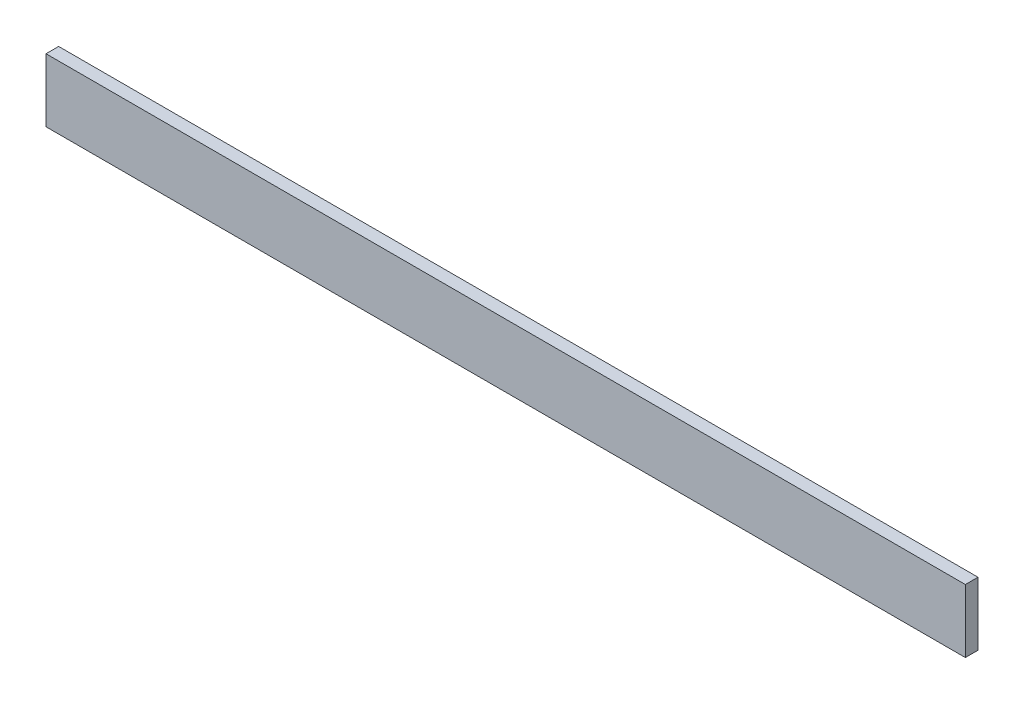
ISO-10303-21;
HEADER;
FILE_DESCRIPTION(('STEP AP214'),'2;1');
FILE_NAME('part.step','',(''),(''),'','','');
FILE_SCHEMA(('AUTOMOTIVE_DESIGN { 1 0 10303 214 1 1 1 1 }'));
ENDSEC;
DATA;
#1=APPLICATION_CONTEXT('core data for automotive mechanical design processes');
#2=APPLICATION_PROTOCOL_DEFINITION('international standard','automotive_design',2000,#1);
#3=PRODUCT_CONTEXT('',#1,'mechanical');
#4=PRODUCT('Part','Part','',(#3));
#5=PRODUCT_RELATED_PRODUCT_CATEGORY('part','',(#4));
#6=PRODUCT_DEFINITION_FORMATION('','',#4);
#7=PRODUCT_DEFINITION_CONTEXT('part definition',#1,'design');
#8=PRODUCT_DEFINITION('design','',#6,#7);
#9=PRODUCT_DEFINITION_SHAPE('','',#8);
#10=(LENGTH_UNIT() NAMED_UNIT(*) SI_UNIT(.MILLI.,.METRE.));
#11=(NAMED_UNIT(*) PLANE_ANGLE_UNIT() SI_UNIT($,.RADIAN.));
#12=(NAMED_UNIT(*) SI_UNIT($,.STERADIAN.) SOLID_ANGLE_UNIT());
#13=UNCERTAINTY_MEASURE_WITH_UNIT(LENGTH_MEASURE(1.E-05),#10,'distance_accuracy_value','');
#14=(GEOMETRIC_REPRESENTATION_CONTEXT(3) GLOBAL_UNCERTAINTY_ASSIGNED_CONTEXT((#13)) GLOBAL_UNIT_ASSIGNED_CONTEXT((#10,
#11,#12)) REPRESENTATION_CONTEXT('',''));
#15=CARTESIAN_POINT('',(0.,0.,0.));
#16=DIRECTION('',(0.,0.,1.));
#17=DIRECTION('',(1.,0.,0.));
#18=AXIS2_PLACEMENT_3D('',#15,#16,#17);
#19=CARTESIAN_POINT('',(0.,0.,38.1));
#20=DIRECTION('',(1.,0.,0.));
#21=DIRECTION('',(0.,0.,-1.));
#22=AXIS2_PLACEMENT_3D('',#19,#20,#21);
#23=PLANE('',#22);
#24=DIRECTION('',(0.,-1.,0.));
#25=VECTOR('',#24,1.);
#26=CARTESIAN_POINT('',(0.,0.,0.));
#27=LINE('',#26,#25);
#28=CARTESIAN_POINT('',(0.,190.5,0.));
#29=VERTEX_POINT('',#28);
#30=CARTESIAN_POINT('',(0.,0.,0.));
#31=VERTEX_POINT('',#30);
#32=EDGE_CURVE('E96',#29,#31,#27,.T.);
#33=ORIENTED_EDGE('',*,*,#32,.T.);
#34=DIRECTION('',(0.,0.,-1.));
#35=VECTOR('',#34,1.);
#36=CARTESIAN_POINT('',(0.,0.,38.1));
#37=LINE('',#36,#35);
#38=CARTESIAN_POINT('',(0.,0.,38.1));
#39=VERTEX_POINT('',#38);
#40=EDGE_CURVE('E11',#39,#31,#37,.T.);
#41=ORIENTED_EDGE('',*,*,#40,.F.);
#42=DIRECTION('',(0.,-1.,0.));
#43=VECTOR('',#42,1.);
#44=CARTESIAN_POINT('',(0.,0.,38.1));
#45=LINE('',#44,#43);
#46=CARTESIAN_POINT('',(0.,190.5,38.1));
#47=VERTEX_POINT('',#46);
#48=EDGE_CURVE('E84',#47,#39,#45,.T.);
#49=ORIENTED_EDGE('',*,*,#48,.F.);
#50=DIRECTION('',(0.,0.,-1.));
#51=VECTOR('',#50,1.);
#52=CARTESIAN_POINT('',(0.,190.5,38.1));
#53=LINE('',#52,#51);
#54=EDGE_CURVE('E92',#47,#29,#53,.T.);
#55=ORIENTED_EDGE('',*,*,#54,.T.);
#56=EDGE_LOOP('',(#33,#41,#49,#55));
#57=FACE_BOUND('',#56,.T.);
#58=ADVANCED_FACE('F33',(#57),#23,.F.);
#59=CARTESIAN_POINT('',(0.,0.,38.1));
#60=DIRECTION('',(0.,1.,0.));
#61=DIRECTION('',(0.,0.,1.));
#62=AXIS2_PLACEMENT_3D('',#59,#60,#61);
#63=PLANE('',#62);
#64=DIRECTION('',(1.,0.,0.));
#65=VECTOR('',#64,1.);
#66=CARTESIAN_POINT('',(0.,0.,0.));
#67=LINE('',#66,#65);
#68=CARTESIAN_POINT('',(2768.6,0.,0.));
#69=VERTEX_POINT('',#68);
#70=EDGE_CURVE('E88',#31,#69,#67,.T.);
#71=ORIENTED_EDGE('',*,*,#70,.T.);
#72=DIRECTION('',(0.,0.,-1.));
#73=VECTOR('',#72,1.);
#74=CARTESIAN_POINT('',(2768.6,0.,38.1));
#75=LINE('',#74,#73);
#76=CARTESIAN_POINT('',(2768.6,0.,38.1));
#77=VERTEX_POINT('',#76);
#78=EDGE_CURVE('E41',#77,#69,#75,.T.);
#79=ORIENTED_EDGE('',*,*,#78,.F.);
#80=DIRECTION('',(1.,0.,0.));
#81=VECTOR('',#80,1.);
#82=CARTESIAN_POINT('',(0.,0.,38.1));
#83=LINE('',#82,#81);
#84=EDGE_CURVE('E79',#39,#77,#83,.T.);
#85=ORIENTED_EDGE('',*,*,#84,.F.);
#86=ORIENTED_EDGE('',*,*,#40,.T.);
#87=EDGE_LOOP('',(#71,#79,#85,#86));
#88=FACE_BOUND('',#87,.T.);
#89=ADVANCED_FACE('F87',(#88),#63,.F.);
#90=CARTESIAN_POINT('',(2768.6,0.,38.1));
#91=DIRECTION('',(-1.,0.,0.));
#92=DIRECTION('',(0.,0.,1.));
#93=AXIS2_PLACEMENT_3D('',#90,#91,#92);
#94=PLANE('',#93);
#95=DIRECTION('',(0.,1.,0.));
#96=VECTOR('',#95,1.);
#97=CARTESIAN_POINT('',(2768.6,0.,0.));
#98=LINE('',#97,#96);
#99=CARTESIAN_POINT('',(2768.6,190.5,0.));
#100=VERTEX_POINT('',#99);
#101=EDGE_CURVE('E66',#69,#100,#98,.T.);
#102=ORIENTED_EDGE('',*,*,#101,.T.);
#103=DIRECTION('',(0.,0.,-1.));
#104=VECTOR('',#103,1.);
#105=CARTESIAN_POINT('',(2768.6,190.5,38.1));
#106=LINE('',#105,#104);
#107=CARTESIAN_POINT('',(2768.6,190.5,38.1));
#108=VERTEX_POINT('',#107);
#109=EDGE_CURVE('E89',#108,#100,#106,.T.);
#110=ORIENTED_EDGE('',*,*,#109,.F.);
#111=DIRECTION('',(0.,1.,0.));
#112=VECTOR('',#111,1.);
#113=CARTESIAN_POINT('',(2768.6,0.,38.1));
#114=LINE('',#113,#112);
#115=EDGE_CURVE('E82',#77,#108,#114,.T.);
#116=ORIENTED_EDGE('',*,*,#115,.F.);
#117=ORIENTED_EDGE('',*,*,#78,.T.);
#118=EDGE_LOOP('',(#102,#110,#116,#117));
#119=FACE_BOUND('',#118,.T.);
#120=ADVANCED_FACE('F90',(#119),#94,.F.);
#121=CARTESIAN_POINT('',(0.,190.5,38.1));
#122=DIRECTION('',(0.,-1.,0.));
#123=DIRECTION('',(0.,0.,-1.));
#124=AXIS2_PLACEMENT_3D('',#121,#122,#123);
#125=PLANE('',#124);
#126=DIRECTION('',(-1.,0.,0.));
#127=VECTOR('',#126,1.);
#128=CARTESIAN_POINT('',(0.,190.5,0.));
#129=LINE('',#128,#127);
#130=EDGE_CURVE('E72',#100,#29,#129,.T.);
#131=ORIENTED_EDGE('',*,*,#130,.T.);
#132=ORIENTED_EDGE('',*,*,#54,.F.);
#133=DIRECTION('',(-1.,0.,0.));
#134=VECTOR('',#133,1.);
#135=CARTESIAN_POINT('',(0.,190.5,38.1));
#136=LINE('',#135,#134);
#137=EDGE_CURVE('E49',#108,#47,#136,.T.);
#138=ORIENTED_EDGE('',*,*,#137,.F.);
#139=ORIENTED_EDGE('',*,*,#109,.T.);
#140=EDGE_LOOP('',(#131,#132,#138,#139));
#141=FACE_BOUND('',#140,.T.);
#142=ADVANCED_FACE('F103',(#141),#125,.F.);
#143=CARTESIAN_POINT('',(0.,0.,38.1));
#144=DIRECTION('',(0.,0.,-1.));
#145=DIRECTION('',(-1.,0.,0.));
#146=AXIS2_PLACEMENT_3D('',#143,#144,#145);
#147=PLANE('',#146);
#148=ORIENTED_EDGE('',*,*,#48,.T.);
#149=ORIENTED_EDGE('',*,*,#84,.T.);
#150=ORIENTED_EDGE('',*,*,#115,.T.);
#151=ORIENTED_EDGE('',*,*,#137,.T.);
#152=EDGE_LOOP('',(#148,#149,#150,#151));
#153=FACE_BOUND('',#152,.T.);
#154=ADVANCED_FACE('F80',(#153),#147,.F.);
#155=CARTESIAN_POINT('',(0.,0.,0.));
#156=DIRECTION('',(0.,0.,-1.));
#157=DIRECTION('',(-1.,0.,0.));
#158=AXIS2_PLACEMENT_3D('',#155,#156,#157);
#159=PLANE('',#158);
#160=ORIENTED_EDGE('',*,*,#32,.F.);
#161=ORIENTED_EDGE('',*,*,#130,.F.);
#162=ORIENTED_EDGE('',*,*,#101,.F.);
#163=ORIENTED_EDGE('',*,*,#70,.F.);
#164=EDGE_LOOP('',(#160,#161,#162,#163));
#165=FACE_BOUND('',#164,.T.);
#166=ADVANCED_FACE('F106',(#165),#159,.T.);
#167=CLOSED_SHELL('',(#58,#89,#120,#142,#154,#166));
#168=MANIFOLD_SOLID_BREP('B2',#167);
#169=ADVANCED_BREP_SHAPE_REPRESENTATION('',(#18,#168),#14);
#170=SHAPE_DEFINITION_REPRESENTATION(#9,#169);
ENDSEC;
END-ISO-10303-21;
